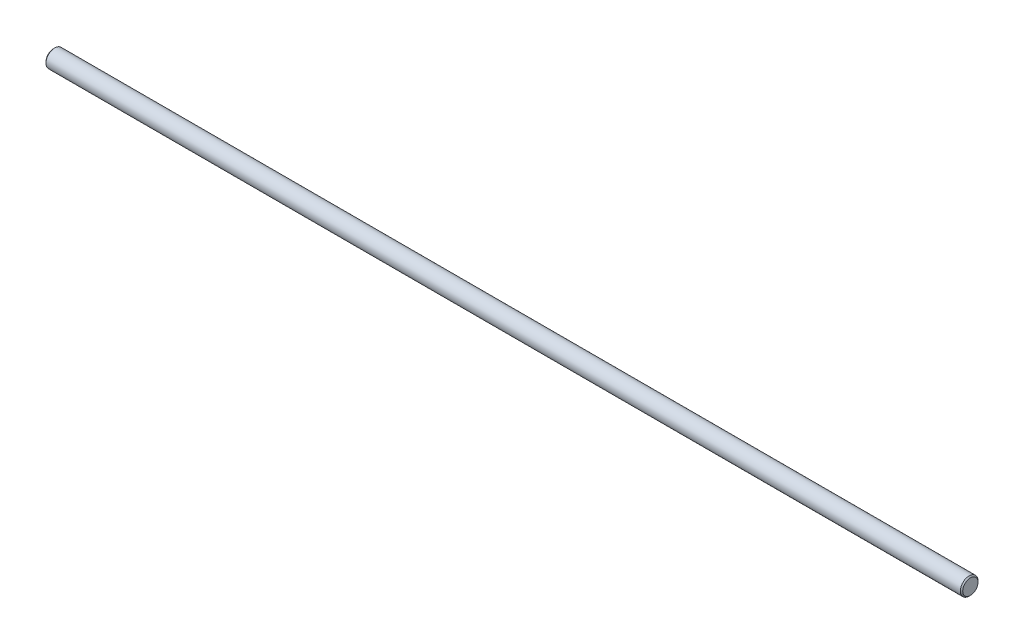
ISO-10303-21;
HEADER;
FILE_DESCRIPTION(('STEP AP214'),'2;1');
FILE_NAME('part.step','',(''),(''),'','','');
FILE_SCHEMA(('AUTOMOTIVE_DESIGN { 1 0 10303 214 1 1 1 1 }'));
ENDSEC;
DATA;
#1=APPLICATION_CONTEXT('core data for automotive mechanical design processes');
#2=APPLICATION_PROTOCOL_DEFINITION('international standard','automotive_design',2000,#1);
#3=PRODUCT_CONTEXT('',#1,'mechanical');
#4=PRODUCT('Part','Part','',(#3));
#5=PRODUCT_RELATED_PRODUCT_CATEGORY('part','',(#4));
#6=PRODUCT_DEFINITION_FORMATION('','',#4);
#7=PRODUCT_DEFINITION_CONTEXT('part definition',#1,'design');
#8=PRODUCT_DEFINITION('design','',#6,#7);
#9=PRODUCT_DEFINITION_SHAPE('','',#8);
#10=(LENGTH_UNIT() NAMED_UNIT(*) SI_UNIT(.MILLI.,.METRE.));
#11=(NAMED_UNIT(*) PLANE_ANGLE_UNIT() SI_UNIT($,.RADIAN.));
#12=(NAMED_UNIT(*) SI_UNIT($,.STERADIAN.) SOLID_ANGLE_UNIT());
#13=UNCERTAINTY_MEASURE_WITH_UNIT(LENGTH_MEASURE(1.E-05),#10,'distance_accuracy_value','');
#14=(GEOMETRIC_REPRESENTATION_CONTEXT(3) GLOBAL_UNCERTAINTY_ASSIGNED_CONTEXT((#13)) GLOBAL_UNIT_ASSIGNED_CONTEXT((#10,
#11,#12)) REPRESENTATION_CONTEXT('',''));
#15=CARTESIAN_POINT('',(0.,0.,0.));
#16=DIRECTION('',(0.,0.,1.));
#17=DIRECTION('',(1.,0.,0.));
#18=AXIS2_PLACEMENT_3D('',#15,#16,#17);
#19=CARTESIAN_POINT('',(156.,0.,0.));
#20=DIRECTION('',(-1.,0.,0.));
#21=DIRECTION('',(0.,0.,1.));
#22=AXIS2_PLACEMENT_3D('',#19,#20,#21);
#23=CYLINDRICAL_SURFACE('',#22,1.5);
#24=CARTESIAN_POINT('',(0.200000000000033,0.,0.));
#25=DIRECTION('',(1.,0.,0.));
#26=DIRECTION('',(0.,0.,-1.));
#27=AXIS2_PLACEMENT_3D('',#24,#25,#26);
#28=CIRCLE('',#27,1.5);
#29=CARTESIAN_POINT('',(0.200000000000033,0.,-1.5));
#30=VERTEX_POINT('',#29);
#31=EDGE_CURVE('E41',#30,#30,#28,.T.);
#32=ORIENTED_EDGE('',*,*,#31,.T.);
#33=EDGE_LOOP('',(#32));
#34=FACE_BOUND('',#33,.T.);
#35=CARTESIAN_POINT('',(155.8,0.,0.));
#36=DIRECTION('',(1.,0.,0.));
#37=DIRECTION('',(0.,0.,-1.));
#38=AXIS2_PLACEMENT_3D('',#35,#36,#37);
#39=CIRCLE('',#38,1.5);
#40=CARTESIAN_POINT('',(155.8,0.,-1.5));
#41=VERTEX_POINT('',#40);
#42=EDGE_CURVE('E45',#41,#41,#39,.F.);
#43=ORIENTED_EDGE('',*,*,#42,.T.);
#44=EDGE_LOOP('',(#43));
#45=FACE_BOUND('',#44,.T.);
#46=ADVANCED_FACE('F30',(#34,#45),#23,.T.);
#47=CARTESIAN_POINT('',(156.,0.,0.));
#48=DIRECTION('',(1.,0.,0.));
#49=DIRECTION('',(0.,0.,-1.));
#50=AXIS2_PLACEMENT_3D('',#47,#48,#49);
#51=PLANE('',#50);
#52=CARTESIAN_POINT('',(156.,0.,0.));
#53=DIRECTION('',(1.,0.,0.));
#54=DIRECTION('',(0.,0.,-1.));
#55=AXIS2_PLACEMENT_3D('',#52,#53,#54);
#56=CIRCLE('',#55,1.29999999999998);
#57=CARTESIAN_POINT('',(156.,0.,-1.29999999999998));
#58=VERTEX_POINT('',#57);
#59=EDGE_CURVE('E10',#58,#58,#56,.T.);
#60=ORIENTED_EDGE('',*,*,#59,.T.);
#61=EDGE_LOOP('',(#60));
#62=FACE_BOUND('',#61,.T.);
#63=ADVANCED_FACE('F61',(#62),#51,.T.);
#64=CARTESIAN_POINT('',(0.,0.,0.));
#65=DIRECTION('',(1.,0.,0.));
#66=DIRECTION('',(0.,0.,-1.));
#67=AXIS2_PLACEMENT_3D('',#64,#65,#66);
#68=PLANE('',#67);
#69=CARTESIAN_POINT('',(0.,0.,0.));
#70=DIRECTION('',(1.,0.,0.));
#71=DIRECTION('',(0.,0.,-1.));
#72=AXIS2_PLACEMENT_3D('',#69,#70,#71);
#73=CIRCLE('',#72,1.29999999999998);
#74=CARTESIAN_POINT('',(0.,0.,-1.29999999999998));
#75=VERTEX_POINT('',#74);
#76=EDGE_CURVE('E37',#75,#75,#73,.F.);
#77=ORIENTED_EDGE('',*,*,#76,.T.);
#78=EDGE_LOOP('',(#77));
#79=FACE_BOUND('',#78,.T.);
#80=ADVANCED_FACE('F58',(#79),#68,.F.);
#81=CARTESIAN_POINT('',(0.200000000000033,0.,0.));
#82=DIRECTION('',(1.,0.,0.));
#83=DIRECTION('',(0.,0.,-1.));
#84=AXIS2_PLACEMENT_3D('',#81,#82,#83);
#85=CONICAL_SURFACE('',#84,1.5,0.78539816339741);
#86=ORIENTED_EDGE('',*,*,#76,.F.);
#87=EDGE_LOOP('',(#86));
#88=FACE_BOUND('',#87,.T.);
#89=ORIENTED_EDGE('',*,*,#31,.F.);
#90=EDGE_LOOP('',(#89));
#91=FACE_BOUND('',#90,.T.);
#92=ADVANCED_FACE('F54',(#88,#91),#85,.T.);
#93=CARTESIAN_POINT('',(156.,0.,0.));
#94=DIRECTION('',(-1.,0.,0.));
#95=DIRECTION('',(0.,0.,1.));
#96=AXIS2_PLACEMENT_3D('',#93,#94,#95);
#97=CONICAL_SURFACE('',#96,1.29999999999998,0.78539816339748);
#98=ORIENTED_EDGE('',*,*,#42,.F.);
#99=EDGE_LOOP('',(#98));
#100=FACE_BOUND('',#99,.T.);
#101=ORIENTED_EDGE('',*,*,#59,.F.);
#102=EDGE_LOOP('',(#101));
#103=FACE_BOUND('',#102,.T.);
#104=ADVANCED_FACE('F32',(#100,#103),#97,.T.);
#105=CLOSED_SHELL('',(#46,#63,#80,#92,#104));
#106=MANIFOLD_SOLID_BREP('B2',#105);
#107=ADVANCED_BREP_SHAPE_REPRESENTATION('',(#18,#106),#14);
#108=SHAPE_DEFINITION_REPRESENTATION(#9,#107);
ENDSEC;
END-ISO-10303-21;
